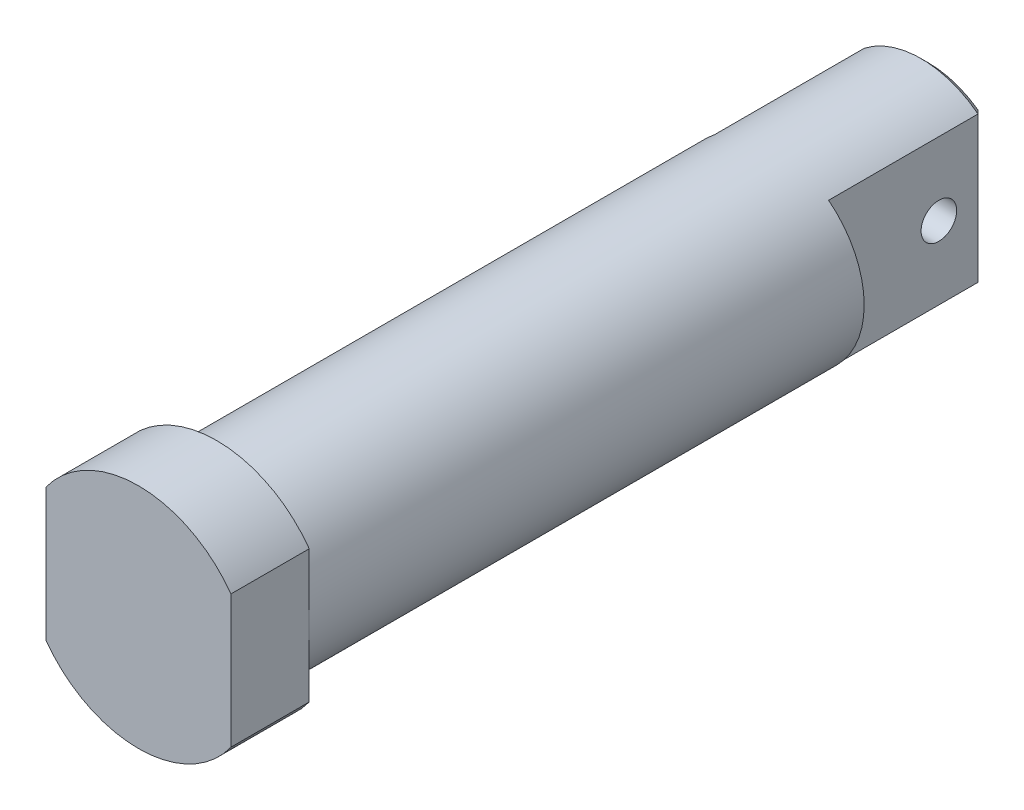
ISO-10303-21;
HEADER;
FILE_DESCRIPTION(('STEP AP214'),'2;1');
FILE_NAME('part.step','',(''),(''),'','','');
FILE_SCHEMA(('AUTOMOTIVE_DESIGN { 1 0 10303 214 1 1 1 1 }'));
ENDSEC;
DATA;
#1=APPLICATION_CONTEXT('core data for automotive mechanical design processes');
#2=APPLICATION_PROTOCOL_DEFINITION('international standard','automotive_design',2000,#1);
#3=PRODUCT_CONTEXT('',#1,'mechanical');
#4=PRODUCT('Part','Part','',(#3));
#5=PRODUCT_RELATED_PRODUCT_CATEGORY('part','',(#4));
#6=PRODUCT_DEFINITION_FORMATION('','',#4);
#7=PRODUCT_DEFINITION_CONTEXT('part definition',#1,'design');
#8=PRODUCT_DEFINITION('design','',#6,#7);
#9=PRODUCT_DEFINITION_SHAPE('','',#8);
#10=(LENGTH_UNIT() NAMED_UNIT(*) SI_UNIT(.MILLI.,.METRE.));
#11=(NAMED_UNIT(*) PLANE_ANGLE_UNIT() SI_UNIT($,.RADIAN.));
#12=(NAMED_UNIT(*) SI_UNIT($,.STERADIAN.) SOLID_ANGLE_UNIT());
#13=UNCERTAINTY_MEASURE_WITH_UNIT(LENGTH_MEASURE(1.E-05),#10,'distance_accuracy_value','');
#14=(GEOMETRIC_REPRESENTATION_CONTEXT(3) GLOBAL_UNCERTAINTY_ASSIGNED_CONTEXT((#13)) GLOBAL_UNIT_ASSIGNED_CONTEXT((#10,
#11,#12)) REPRESENTATION_CONTEXT('',''));
#15=CARTESIAN_POINT('',(0.,0.,0.));
#16=DIRECTION('',(0.,0.,1.));
#17=DIRECTION('',(1.,0.,0.));
#18=AXIS2_PLACEMENT_3D('',#15,#16,#17);
#19=CARTESIAN_POINT('',(1.11022302462516E-13,0.,-39.));
#20=DIRECTION('',(0.,0.,1.));
#21=DIRECTION('',(1.,0.,0.));
#22=AXIS2_PLACEMENT_3D('',#19,#20,#21);
#23=PLANE('',#22);
#24=DIRECTION('',(0.,1.,0.));
#25=VECTOR('',#24,1.);
#26=CARTESIAN_POINT('',(-8.00000000000006,10.2469507659596,-39.));
#27=LINE('',#26,#25);
#28=CARTESIAN_POINT('',(-8.00000000000015,-10.2469507659595,-39.));
#29=VERTEX_POINT('',#28);
#30=CARTESIAN_POINT('',(-8.00000000000006,10.2469507659596,-39.));
#31=VERTEX_POINT('',#30);
#32=EDGE_CURVE('E140',#29,#31,#27,.T.);
#33=ORIENTED_EDGE('',*,*,#32,.F.);
#34=CARTESIAN_POINT('',(1.11022302462516E-13,0.,-39.));
#35=DIRECTION('',(0.,0.,1.));
#36=DIRECTION('',(1.,0.,0.));
#37=AXIS2_PLACEMENT_3D('',#34,#35,#36);
#38=CIRCLE('',#37,13.);
#39=EDGE_CURVE('E136',#31,#29,#38,.T.);
#40=ORIENTED_EDGE('',*,*,#39,.F.);
#41=EDGE_LOOP('',(#33,#40));
#42=FACE_BOUND('',#41,.T.);
#43=ADVANCED_FACE('F45',(#42),#23,.F.);
#44=DIRECTION('',(0.,-1.,0.));
#45=VECTOR('',#44,1.);
#46=CARTESIAN_POINT('',(7.9999999999999,10.2469507659596,-39.));
#47=LINE('',#46,#45);
#48=CARTESIAN_POINT('',(7.9999999999999,10.2469507659596,-39.));
#49=VERTEX_POINT('',#48);
#50=CARTESIAN_POINT('',(7.99999999999987,-10.2469507659596,-39.));
#51=VERTEX_POINT('',#50);
#52=EDGE_CURVE('E135',#49,#51,#47,.T.);
#53=ORIENTED_EDGE('',*,*,#52,.F.);
#54=EDGE_CURVE('E127',#51,#49,#38,.T.);
#55=ORIENTED_EDGE('',*,*,#54,.F.);
#56=EDGE_LOOP('',(#53,#55));
#57=FACE_BOUND('',#56,.T.);
#58=ADVANCED_FACE('F134',(#57),#23,.F.);
#59=CARTESIAN_POINT('',(0.,-1.11022302462516E-13,39.));
#60=DIRECTION('',(0.,0.,-1.));
#61=DIRECTION('',(-1.,0.,0.));
#62=AXIS2_PLACEMENT_3D('',#59,#60,#61);
#63=CYLINDRICAL_SURFACE('',#62,13.);
#64=CARTESIAN_POINT('',(0.,-1.11022302462516E-13,39.));
#65=DIRECTION('',(0.,0.,1.));
#66=DIRECTION('',(1.,0.,0.));
#67=AXIS2_PLACEMENT_3D('',#64,#65,#66);
#68=CIRCLE('',#67,13.);
#69=CARTESIAN_POINT('',(13.0000000000001,2.22044604925031E-13,39.));
#70=VERTEX_POINT('',#69);
#71=CARTESIAN_POINT('',(-13.,2.22044604925031E-13,39.));
#72=VERTEX_POINT('',#71);
#73=EDGE_CURVE('E245',#70,#72,#68,.T.);
#74=ORIENTED_EDGE('',*,*,#73,.F.);
#75=EDGE_CURVE('E249',#72,#70,#68,.T.);
#76=ORIENTED_EDGE('',*,*,#75,.F.);
#77=EDGE_LOOP('',(#74,#76));
#78=FACE_BOUND('',#77,.T.);
#79=DIRECTION('',(0.,0.,1.));
#80=VECTOR('',#79,1.);
#81=CARTESIAN_POINT('',(8.00000000000001,10.2469507659596,-61.));
#82=LINE('',#81,#80);
#83=CARTESIAN_POINT('',(8.00000000000001,10.2469507659596,-60.));
#84=VERTEX_POINT('',#83);
#85=EDGE_CURVE('E129',#84,#49,#82,.T.);
#86=ORIENTED_EDGE('',*,*,#85,.F.);
#87=CARTESIAN_POINT('',(0.,0.,-60.));
#88=DIRECTION('',(0.,0.,-1.));
#89=DIRECTION('',(-1.,0.,0.));
#90=AXIS2_PLACEMENT_3D('',#87,#88,#89);
#91=CIRCLE('',#90,13.);
#92=CARTESIAN_POINT('',(-8.00000000000001,10.2469507659596,-60.));
#93=VERTEX_POINT('',#92);
#94=EDGE_CURVE('E53',#84,#93,#91,.F.);
#95=ORIENTED_EDGE('',*,*,#94,.T.);
#96=DIRECTION('',(0.,0.,1.));
#97=VECTOR('',#96,1.);
#98=CARTESIAN_POINT('',(-8.00000000000001,10.2469507659596,-61.));
#99=LINE('',#98,#97);
#100=EDGE_CURVE('E144',#93,#31,#99,.T.);
#101=ORIENTED_EDGE('',*,*,#100,.T.);
#102=ORIENTED_EDGE('',*,*,#39,.T.);
#103=DIRECTION('',(0.,0.,1.));
#104=VECTOR('',#103,1.);
#105=CARTESIAN_POINT('',(-8.00000000000001,-10.2469507659595,-61.));
#106=LINE('',#105,#104);
#107=CARTESIAN_POINT('',(-8.00000000000001,-10.2469507659595,-60.));
#108=VERTEX_POINT('',#107);
#109=EDGE_CURVE('E130',#108,#29,#106,.T.);
#110=ORIENTED_EDGE('',*,*,#109,.F.);
#111=CARTESIAN_POINT('',(0.,0.,-60.));
#112=DIRECTION('',(0.,0.,-1.));
#113=DIRECTION('',(-1.,0.,0.));
#114=AXIS2_PLACEMENT_3D('',#111,#112,#113);
#115=CIRCLE('',#114,13.);
#116=CARTESIAN_POINT('',(8.00000000000001,-10.2469507659595,-60.));
#117=VERTEX_POINT('',#116);
#118=EDGE_CURVE('E60',#108,#117,#115,.F.);
#119=ORIENTED_EDGE('',*,*,#118,.T.);
#120=DIRECTION('',(0.,0.,1.));
#121=VECTOR('',#120,1.);
#122=CARTESIAN_POINT('',(8.00000000000001,-10.2469507659594,-61.));
#123=LINE('',#122,#121);
#124=EDGE_CURVE('E125',#117,#51,#123,.T.);
#125=ORIENTED_EDGE('',*,*,#124,.T.);
#126=ORIENTED_EDGE('',*,*,#54,.T.);
#127=EDGE_LOOP('',(#86,#95,#101,#102,#110,#119,#125,#126));
#128=FACE_BOUND('',#127,.T.);
#129=ADVANCED_FACE('F47',(#78,#128),#63,.T.);
#130=CARTESIAN_POINT('',(0.,-1.11022302462516E-13,39.));
#131=DIRECTION('',(0.,0.,1.));
#132=DIRECTION('',(1.,0.,0.));
#133=AXIS2_PLACEMENT_3D('',#130,#131,#132);
#134=PLANE('',#133);
#135=DIRECTION('',(0.,1.,0.));
#136=VECTOR('',#135,1.);
#137=CARTESIAN_POINT('',(13.0000000000001,-9.32737905308871,39.));
#138=LINE('',#137,#136);
#139=CARTESIAN_POINT('',(13.0000000000001,9.32737905308892,39.));
#140=VERTEX_POINT('',#139);
#141=EDGE_CURVE('E390',#70,#140,#138,.T.);
#142=ORIENTED_EDGE('',*,*,#141,.F.);
#143=ORIENTED_EDGE('',*,*,#73,.T.);
#144=DIRECTION('',(0.,-1.,0.));
#145=VECTOR('',#144,1.);
#146=CARTESIAN_POINT('',(-12.9999999999999,-9.32737905308871,39.));
#147=LINE('',#146,#145);
#148=CARTESIAN_POINT('',(-12.9999999999999,9.32737905308892,39.));
#149=VERTEX_POINT('',#148);
#150=EDGE_CURVE('E398',#149,#72,#147,.T.);
#151=ORIENTED_EDGE('',*,*,#150,.F.);
#152=CARTESIAN_POINT('',(0.,-1.11022302462516E-13,39.));
#153=DIRECTION('',(0.,0.,1.));
#154=DIRECTION('',(1.,0.,0.));
#155=AXIS2_PLACEMENT_3D('',#152,#153,#154);
#156=CIRCLE('',#155,16.);
#157=EDGE_CURVE('E391',#140,#149,#156,.T.);
#158=ORIENTED_EDGE('',*,*,#157,.F.);
#159=EDGE_LOOP('',(#142,#143,#151,#158));
#160=FACE_BOUND('',#159,.T.);
#161=ADVANCED_FACE('F289',(#160),#134,.F.);
#162=CARTESIAN_POINT('',(-12.9999999999999,-9.32737905308871,39.));
#163=VERTEX_POINT('',#162);
#164=EDGE_CURVE('E387',#72,#163,#147,.T.);
#165=ORIENTED_EDGE('',*,*,#164,.F.);
#166=ORIENTED_EDGE('',*,*,#75,.T.);
#167=CARTESIAN_POINT('',(13.0000000000001,-9.32737905308871,39.));
#168=VERTEX_POINT('',#167);
#169=EDGE_CURVE('E385',#168,#70,#138,.T.);
#170=ORIENTED_EDGE('',*,*,#169,.F.);
#171=CARTESIAN_POINT('',(0.,-1.11022302462516E-13,39.));
#172=DIRECTION('',(0.,0.,1.));
#173=DIRECTION('',(1.,0.,0.));
#174=AXIS2_PLACEMENT_3D('',#171,#172,#173);
#175=CIRCLE('',#174,16.);
#176=EDGE_CURVE('E161',#163,#168,#175,.T.);
#177=ORIENTED_EDGE('',*,*,#176,.F.);
#178=EDGE_LOOP('',(#165,#166,#170,#177));
#179=FACE_BOUND('',#178,.T.);
#180=ADVANCED_FACE('F272',(#179),#134,.F.);
#181=CARTESIAN_POINT('',(0.,0.,50.));
#182=DIRECTION('',(0.,0.,-1.));
#183=DIRECTION('',(-1.,0.,0.));
#184=AXIS2_PLACEMENT_3D('',#181,#182,#183);
#185=CYLINDRICAL_SURFACE('',#184,16.);
#186=ORIENTED_EDGE('',*,*,#176,.T.);
#187=DIRECTION('',(0.,0.,-1.));
#188=VECTOR('',#187,1.);
#189=CARTESIAN_POINT('',(12.9999999999999,-9.32737905308877,50.));
#190=LINE('',#189,#188);
#191=CARTESIAN_POINT('',(12.9999999999999,-9.32737905308877,50.));
#192=VERTEX_POINT('',#191);
#193=EDGE_CURVE('E137',#192,#168,#190,.T.);
#194=ORIENTED_EDGE('',*,*,#193,.F.);
#195=CARTESIAN_POINT('',(0.,0.,50.));
#196=DIRECTION('',(0.,0.,1.));
#197=DIRECTION('',(1.,0.,0.));
#198=AXIS2_PLACEMENT_3D('',#195,#196,#197);
#199=CIRCLE('',#198,16.);
#200=CARTESIAN_POINT('',(-13.0000000000001,-9.32737905308877,50.));
#201=VERTEX_POINT('',#200);
#202=EDGE_CURVE('E400',#201,#192,#199,.T.);
#203=ORIENTED_EDGE('',*,*,#202,.F.);
#204=DIRECTION('',(0.,0.,-1.));
#205=VECTOR('',#204,1.);
#206=CARTESIAN_POINT('',(-13.0000000000001,-9.32737905308877,50.));
#207=LINE('',#206,#205);
#208=EDGE_CURVE('E409',#201,#163,#207,.T.);
#209=ORIENTED_EDGE('',*,*,#208,.T.);
#210=EDGE_LOOP('',(#186,#194,#203,#209));
#211=FACE_BOUND('',#210,.T.);
#212=ADVANCED_FACE('F268',(#211),#185,.T.);
#213=CARTESIAN_POINT('',(12.9999999999999,-9.32737905308877,50.));
#214=DIRECTION('',(-1.,0.,0.));
#215=DIRECTION('',(0.,0.,1.));
#216=AXIS2_PLACEMENT_3D('',#213,#214,#215);
#217=PLANE('',#216);
#218=ORIENTED_EDGE('',*,*,#169,.T.);
#219=ORIENTED_EDGE('',*,*,#141,.T.);
#220=DIRECTION('',(0.,0.,-1.));
#221=VECTOR('',#220,1.);
#222=CARTESIAN_POINT('',(13.0000000000001,9.32737905308903,50.));
#223=LINE('',#222,#221);
#224=CARTESIAN_POINT('',(13.0000000000001,9.32737905308903,50.));
#225=VERTEX_POINT('',#224);
#226=EDGE_CURVE('E415',#225,#140,#223,.T.);
#227=ORIENTED_EDGE('',*,*,#226,.F.);
#228=DIRECTION('',(0.,1.,0.));
#229=VECTOR('',#228,1.);
#230=CARTESIAN_POINT('',(12.9999999999999,-9.32737905308877,50.));
#231=LINE('',#230,#229);
#232=EDGE_CURVE('E403',#192,#225,#231,.T.);
#233=ORIENTED_EDGE('',*,*,#232,.F.);
#234=ORIENTED_EDGE('',*,*,#193,.T.);
#235=EDGE_LOOP('',(#218,#219,#227,#233,#234));
#236=FACE_BOUND('',#235,.T.);
#237=ADVANCED_FACE('F271',(#236),#217,.F.);
#238=CARTESIAN_POINT('',(0.,0.,50.));
#239=DIRECTION('',(0.,0.,-1.));
#240=DIRECTION('',(-1.,0.,0.));
#241=AXIS2_PLACEMENT_3D('',#238,#239,#240);
#242=CYLINDRICAL_SURFACE('',#241,16.);
#243=ORIENTED_EDGE('',*,*,#157,.T.);
#244=DIRECTION('',(0.,0.,-1.));
#245=VECTOR('',#244,1.);
#246=CARTESIAN_POINT('',(-12.9999999999999,9.32737905308903,50.));
#247=LINE('',#246,#245);
#248=CARTESIAN_POINT('',(-12.9999999999999,9.32737905308903,50.));
#249=VERTEX_POINT('',#248);
#250=EDGE_CURVE('E412',#249,#149,#247,.T.);
#251=ORIENTED_EDGE('',*,*,#250,.F.);
#252=CARTESIAN_POINT('',(0.,0.,50.));
#253=DIRECTION('',(0.,0.,1.));
#254=DIRECTION('',(1.,0.,0.));
#255=AXIS2_PLACEMENT_3D('',#252,#253,#254);
#256=CIRCLE('',#255,16.);
#257=EDGE_CURVE('E405',#225,#249,#256,.T.);
#258=ORIENTED_EDGE('',*,*,#257,.F.);
#259=ORIENTED_EDGE('',*,*,#226,.T.);
#260=EDGE_LOOP('',(#243,#251,#258,#259));
#261=FACE_BOUND('',#260,.T.);
#262=ADVANCED_FACE('F276',(#261),#242,.T.);
#263=CARTESIAN_POINT('',(-13.0000000000001,-9.32737905308877,50.));
#264=DIRECTION('',(1.,0.,0.));
#265=DIRECTION('',(0.,0.,-1.));
#266=AXIS2_PLACEMENT_3D('',#263,#264,#265);
#267=PLANE('',#266);
#268=ORIENTED_EDGE('',*,*,#150,.T.);
#269=ORIENTED_EDGE('',*,*,#164,.T.);
#270=ORIENTED_EDGE('',*,*,#208,.F.);
#271=DIRECTION('',(0.,-1.,0.));
#272=VECTOR('',#271,1.);
#273=CARTESIAN_POINT('',(-13.0000000000001,-9.32737905308877,50.));
#274=LINE('',#273,#272);
#275=EDGE_CURVE('E407',#249,#201,#274,.T.);
#276=ORIENTED_EDGE('',*,*,#275,.F.);
#277=ORIENTED_EDGE('',*,*,#250,.T.);
#278=EDGE_LOOP('',(#268,#269,#270,#276,#277));
#279=FACE_BOUND('',#278,.T.);
#280=ADVANCED_FACE('F280',(#279),#267,.F.);
#281=CARTESIAN_POINT('',(0.,0.,50.));
#282=DIRECTION('',(0.,0.,1.));
#283=DIRECTION('',(1.,0.,0.));
#284=AXIS2_PLACEMENT_3D('',#281,#282,#283);
#285=PLANE('',#284);
#286=ORIENTED_EDGE('',*,*,#202,.T.);
#287=ORIENTED_EDGE('',*,*,#232,.T.);
#288=ORIENTED_EDGE('',*,*,#257,.T.);
#289=ORIENTED_EDGE('',*,*,#275,.T.);
#290=EDGE_LOOP('',(#286,#287,#288,#289));
#291=FACE_BOUND('',#290,.T.);
#292=ADVANCED_FACE('F284',(#291),#285,.T.);
#293=CARTESIAN_POINT('',(8.00000000000001,10.2469507659596,-61.));
#294=DIRECTION('',(-1.,0.,0.));
#295=DIRECTION('',(0.,0.,1.));
#296=AXIS2_PLACEMENT_3D('',#293,#294,#295);
#297=PLANE('',#296);
#298=CARTESIAN_POINT('',(8.00000000000012,-1.80411241501588E-13,-54.5));
#299=DIRECTION('',(1.,0.,0.));
#300=DIRECTION('',(0.,0.,-1.));
#301=AXIS2_PLACEMENT_3D('',#298,#299,#300);
#302=CIRCLE('',#301,2.5);
#303=CARTESIAN_POINT('',(8.00000000000012,-1.80411241501588E-13,-57.));
#304=VERTEX_POINT('',#303);
#305=EDGE_CURVE('E147',#304,#304,#302,.T.);
#306=ORIENTED_EDGE('',*,*,#305,.F.);
#307=EDGE_LOOP('',(#306));
#308=FACE_BOUND('',#307,.T.);
#309=ORIENTED_EDGE('',*,*,#124,.F.);
#310=DIRECTION('',(0.,1.,0.));
#311=VECTOR('',#310,1.);
#312=CARTESIAN_POINT('',(8.00000000000001,10.2469507659596,-60.));
#313=LINE('',#312,#311);
#314=EDGE_CURVE('E11',#117,#84,#313,.T.);
#315=ORIENTED_EDGE('',*,*,#314,.T.);
#316=ORIENTED_EDGE('',*,*,#85,.T.);
#317=ORIENTED_EDGE('',*,*,#52,.T.);
#318=EDGE_LOOP('',(#309,#315,#316,#317));
#319=FACE_BOUND('',#318,.T.);
#320=ADVANCED_FACE('F139',(#308,#319),#297,.F.);
#321=CARTESIAN_POINT('',(-8.00000000000001,10.2469507659596,-61.));
#322=DIRECTION('',(1.,0.,0.));
#323=DIRECTION('',(0.,0.,-1.));
#324=AXIS2_PLACEMENT_3D('',#321,#322,#323);
#325=PLANE('',#324);
#326=CARTESIAN_POINT('',(-8.00000000000001,1.11022302462516E-13,-54.5));
#327=DIRECTION('',(1.,0.,0.));
#328=DIRECTION('',(0.,0.,-1.));
#329=AXIS2_PLACEMENT_3D('',#326,#327,#328);
#330=CIRCLE('',#329,2.5);
#331=CARTESIAN_POINT('',(-8.00000000000001,1.11022302462516E-13,-57.));
#332=VERTEX_POINT('',#331);
#333=EDGE_CURVE('E141',#332,#332,#330,.T.);
#334=ORIENTED_EDGE('',*,*,#333,.T.);
#335=EDGE_LOOP('',(#334));
#336=FACE_BOUND('',#335,.T.);
#337=ORIENTED_EDGE('',*,*,#100,.F.);
#338=DIRECTION('',(0.,-1.,0.));
#339=VECTOR('',#338,1.);
#340=CARTESIAN_POINT('',(-8.00000000000001,-10.2469507659595,-60.));
#341=LINE('',#340,#339);
#342=EDGE_CURVE('E174',#93,#108,#341,.T.);
#343=ORIENTED_EDGE('',*,*,#342,.T.);
#344=ORIENTED_EDGE('',*,*,#109,.T.);
#345=ORIENTED_EDGE('',*,*,#32,.T.);
#346=EDGE_LOOP('',(#337,#343,#344,#345));
#347=FACE_BOUND('',#346,.T.);
#348=ADVANCED_FACE('F188',(#336,#347),#325,.F.);
#349=CARTESIAN_POINT('',(-1.38777878078145E-13,0.,-61.));
#350=DIRECTION('',(0.,0.,-1.));
#351=DIRECTION('',(-1.,0.,0.));
#352=AXIS2_PLACEMENT_3D('',#349,#350,#351);
#353=PLANE('',#352);
#354=CARTESIAN_POINT('',(-1.38777878078145E-13,0.,-61.));
#355=DIRECTION('',(0.,0.,-1.));
#356=DIRECTION('',(-1.,0.,0.));
#357=AXIS2_PLACEMENT_3D('',#354,#355,#356);
#358=CIRCLE('',#357,12.);
#359=CARTESIAN_POINT('',(6.99999999999998,-9.74679434480891,-61.));
#360=VERTEX_POINT('',#359);
#361=CARTESIAN_POINT('',(-6.99999999999992,-9.74679434480889,-61.));
#362=VERTEX_POINT('',#361);
#363=EDGE_CURVE('E244',#360,#362,#358,.T.);
#364=ORIENTED_EDGE('',*,*,#363,.T.);
#365=DIRECTION('',(0.,1.,0.));
#366=VECTOR('',#365,1.);
#367=CARTESIAN_POINT('',(-6.99999999999998,10.2469507659595,-61.));
#368=LINE('',#367,#366);
#369=CARTESIAN_POINT('',(-6.99999999999992,9.74679434480888,-61.));
#370=VERTEX_POINT('',#369);
#371=EDGE_CURVE('E171',#362,#370,#368,.T.);
#372=ORIENTED_EDGE('',*,*,#371,.T.);
#373=CARTESIAN_POINT('',(-1.38777878078145E-13,0.,-61.));
#374=DIRECTION('',(0.,0.,-1.));
#375=DIRECTION('',(-1.,0.,0.));
#376=AXIS2_PLACEMENT_3D('',#373,#374,#375);
#377=CIRCLE('',#376,12.);
#378=CARTESIAN_POINT('',(6.99999999999998,9.74679434480899,-61.));
#379=VERTEX_POINT('',#378);
#380=EDGE_CURVE('E198',#370,#379,#377,.T.);
#381=ORIENTED_EDGE('',*,*,#380,.T.);
#382=DIRECTION('',(0.,-1.,0.));
#383=VECTOR('',#382,1.);
#384=CARTESIAN_POINT('',(6.99999999999998,-10.2469507659595,-61.));
#385=LINE('',#384,#383);
#386=EDGE_CURVE('E241',#379,#360,#385,.T.);
#387=ORIENTED_EDGE('',*,*,#386,.T.);
#388=EDGE_LOOP('',(#364,#372,#381,#387));
#389=FACE_BOUND('',#388,.T.);
#390=ADVANCED_FACE('F251',(#389),#353,.T.);
#391=CARTESIAN_POINT('',(-13.000025,0.,-54.5));
#392=DIRECTION('',(1.,0.,0.));
#393=DIRECTION('',(0.,0.,-1.));
#394=AXIS2_PLACEMENT_3D('',#391,#392,#393);
#395=CYLINDRICAL_SURFACE('',#394,2.5);
#396=ORIENTED_EDGE('',*,*,#305,.T.);
#397=EDGE_LOOP('',(#396));
#398=FACE_BOUND('',#397,.T.);
#399=ORIENTED_EDGE('',*,*,#333,.F.);
#400=EDGE_LOOP('',(#399));
#401=FACE_BOUND('',#400,.T.);
#402=ADVANCED_FACE('F253',(#398,#401),#395,.F.);
#403=CARTESIAN_POINT('',(6.99999999999998,-2.22044604925031E-13,-61.));
#404=DIRECTION('',(0.707106781186545,0.,-0.707106781186551));
#405=DIRECTION('',(-0.707106781186552,0.,-0.707106781186544));
#406=AXIS2_PLACEMENT_3D('',#403,#404,#405);
#407=PLANE('',#406);
#408=CARTESIAN_POINT('',(6.99999999999992,9.74679434480899,-61.));
#409=CARTESIAN_POINT('',(7.16620331638359,9.83200703351892,-60.8337966836164));
#410=CARTESIAN_POINT('',(7.33263835958452,9.91629310483775,-60.6673616404154));
#411=CARTESIAN_POINT('',(7.66597169349104,10.083011909596,-60.334028306509));
#412=CARTESIAN_POINT('',(7.83286998362343,10.1654446453275,-60.1671300163766));
#413=CARTESIAN_POINT('',(7.9999999999999,10.24695076596,-60.0000000000001));
#414=B_SPLINE_CURVE_WITH_KNOTS('',3,(#408,#409,#410,#411,#412,#413),.UNSPECIFIED.,.F.,.F.,(4,2,
4),(0.,0.750032333476714,1.50006373932963),.UNSPECIFIED.);
#415=EDGE_CURVE('E201',#84,#379,#414,.F.);
#416=ORIENTED_EDGE('',*,*,#415,.F.);
#417=ORIENTED_EDGE('',*,*,#314,.F.);
#418=CARTESIAN_POINT('',(8.00000000000001,-10.2469507659595,-60.));
#419=CARTESIAN_POINT('',(7.83286998362349,-10.1654446453273,-60.1671300163765));
#420=CARTESIAN_POINT('',(7.66597169349105,-10.0830119095959,-60.3340283065089));
#421=CARTESIAN_POINT('',(7.33263835958449,-9.91629310483786,-60.6673616404155));
#422=CARTESIAN_POINT('',(7.16620331638356,-9.83200703351909,-60.8337966836164));
#423=CARTESIAN_POINT('',(6.9999999999999,-9.74679434480916,-61.0000000000001));
#424=B_SPLINE_CURVE_WITH_KNOTS('',3,(#418,#419,#420,#421,#422,#423),.UNSPECIFIED.,.F.,.F.,(4,2,
4),(0.,0.750031405852909,1.50006373932961),.UNSPECIFIED.);
#425=EDGE_CURVE('E228',#360,#117,#424,.F.);
#426=ORIENTED_EDGE('',*,*,#425,.F.);
#427=ORIENTED_EDGE('',*,*,#386,.F.);
#428=EDGE_LOOP('',(#416,#417,#426,#427));
#429=FACE_BOUND('',#428,.T.);
#430=ADVANCED_FACE('F223',(#429),#407,.T.);
#431=CARTESIAN_POINT('',(-1.38777878078145E-13,0.,-61.));
#432=DIRECTION('',(0.,0.,1.));
#433=DIRECTION('',(1.,0.,0.));
#434=AXIS2_PLACEMENT_3D('',#431,#432,#433);
#435=CONICAL_SURFACE('',#434,12.,0.78539816339745);
#436=ORIENTED_EDGE('',*,*,#425,.T.);
#437=ORIENTED_EDGE('',*,*,#118,.F.);
#438=CARTESIAN_POINT('',(-8.00000000000001,-10.2469507659595,-60.));
#439=CARTESIAN_POINT('',(-7.83286998362353,-10.1654446453273,-60.1671300163766));
#440=CARTESIAN_POINT('',(-7.66597169349112,-10.083011909596,-60.334028306509));
#441=CARTESIAN_POINT('',(-7.33263835958457,-9.91629310483792,-60.6673616404155));
#442=CARTESIAN_POINT('',(-7.16620331638363,-9.83200703351913,-60.8337966836164));
#443=CARTESIAN_POINT('',(-6.99999999999995,-9.74679434480917,-61.0000000000001));
#444=B_SPLINE_CURVE_WITH_KNOTS('',3,(#438,#439,#440,#441,#442,#443),.UNSPECIFIED.,.F.,.F.,(4,2,
4),(0.,0.750031405852898,1.50006373932959),.UNSPECIFIED.);
#445=EDGE_CURVE('E196',#362,#108,#444,.F.);
#446=ORIENTED_EDGE('',*,*,#445,.F.);
#447=ORIENTED_EDGE('',*,*,#363,.F.);
#448=EDGE_LOOP('',(#436,#437,#446,#447));
#449=FACE_BOUND('',#448,.T.);
#450=ADVANCED_FACE('F218',(#449),#435,.T.);
#451=CARTESIAN_POINT('',(-1.38777878078145E-13,0.,-61.));
#452=DIRECTION('',(0.,0.,1.));
#453=DIRECTION('',(1.,0.,0.));
#454=AXIS2_PLACEMENT_3D('',#451,#452,#453);
#455=CONICAL_SURFACE('',#454,12.,0.78539816339745);
#456=ORIENTED_EDGE('',*,*,#415,.T.);
#457=ORIENTED_EDGE('',*,*,#380,.F.);
#458=CARTESIAN_POINT('',(-6.99999999999998,9.74679434480896,-61.));
#459=CARTESIAN_POINT('',(-7.16620331638366,9.83200703351895,-60.8337966836164));
#460=CARTESIAN_POINT('',(-7.33263835958459,9.91629310483781,-60.6673616404155));
#461=CARTESIAN_POINT('',(-7.66597169349109,10.0830119095961,-60.334028306509));
#462=CARTESIAN_POINT('',(-7.83286998362346,10.1654446453276,-60.1671300163766));
#463=CARTESIAN_POINT('',(-7.9999999999999,10.24695076596,-60.0000000000001));
#464=B_SPLINE_CURVE_WITH_KNOTS('',3,(#458,#459,#460,#461,#462,#463),.UNSPECIFIED.,.F.,.F.,(4,2,
4),(0.,0.750032333476692,1.50006373932959),.UNSPECIFIED.);
#465=EDGE_CURVE('E193',#93,#370,#464,.F.);
#466=ORIENTED_EDGE('',*,*,#465,.F.);
#467=ORIENTED_EDGE('',*,*,#94,.F.);
#468=EDGE_LOOP('',(#456,#457,#466,#467));
#469=FACE_BOUND('',#468,.T.);
#470=ADVANCED_FACE('F197',(#469),#455,.T.);
#471=CARTESIAN_POINT('',(-7.00000000000012,0.,-61.));
#472=DIRECTION('',(-0.707106781186545,0.,-0.707106781186551));
#473=DIRECTION('',(-0.707106781186552,0.,0.707106781186544));
#474=AXIS2_PLACEMENT_3D('',#471,#472,#473);
#475=PLANE('',#474);
#476=ORIENTED_EDGE('',*,*,#445,.T.);
#477=ORIENTED_EDGE('',*,*,#342,.F.);
#478=ORIENTED_EDGE('',*,*,#465,.T.);
#479=ORIENTED_EDGE('',*,*,#371,.F.);
#480=EDGE_LOOP('',(#476,#477,#478,#479));
#481=FACE_BOUND('',#480,.T.);
#482=ADVANCED_FACE('F191',(#481),#475,.T.);
#483=CLOSED_SHELL('',(#43,#58,#129,#161,#180,#212,#237,#262,#280,#292,#320,#348,#390,#402,#430,
#450,#470,#482));
#484=MANIFOLD_SOLID_BREP('B2',#483);
#485=ADVANCED_BREP_SHAPE_REPRESENTATION('',(#18,#484),#14);
#486=SHAPE_DEFINITION_REPRESENTATION(#9,#485);
ENDSEC;
END-ISO-10303-21;
